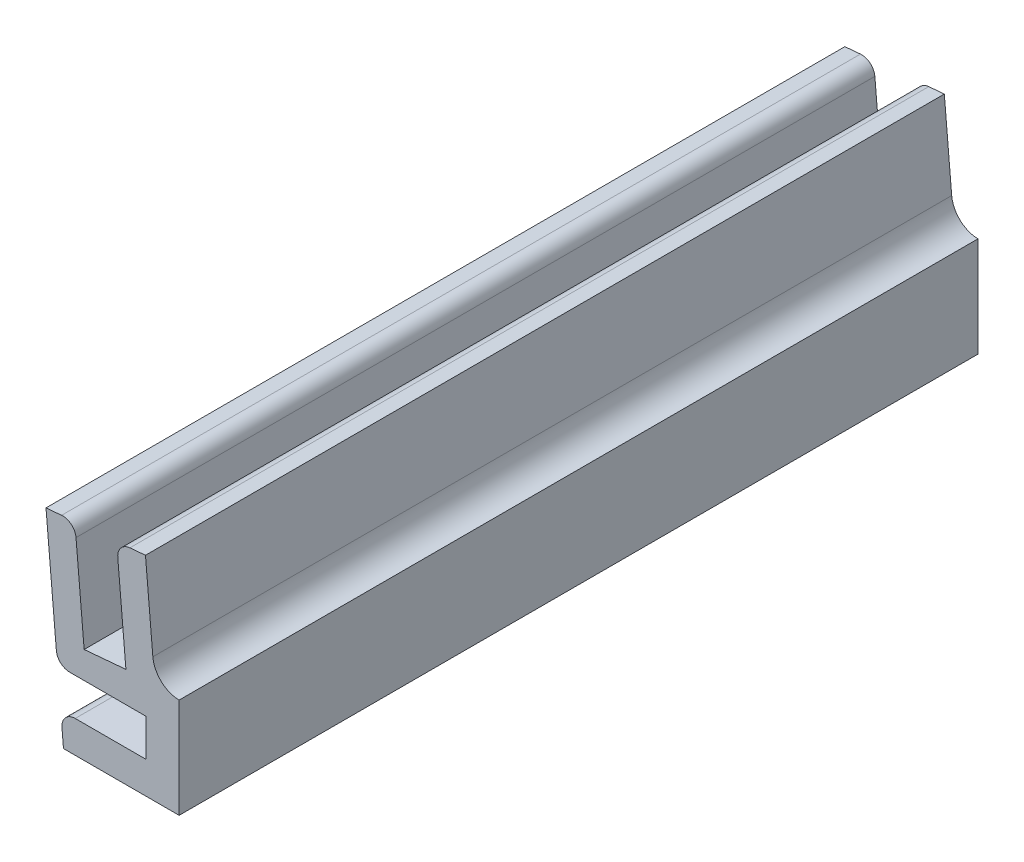
ISO-10303-21;
HEADER;
FILE_DESCRIPTION(('STEP AP214'),'2;1');
FILE_NAME('part.step','',(''),(''),'','','');
FILE_SCHEMA(('AUTOMOTIVE_DESIGN { 1 0 10303 214 1 1 1 1 }'));
ENDSEC;
DATA;
#1=APPLICATION_CONTEXT('core data for automotive mechanical design processes');
#2=APPLICATION_PROTOCOL_DEFINITION('international standard','automotive_design',2000,#1);
#3=PRODUCT_CONTEXT('',#1,'mechanical');
#4=PRODUCT('Part','Part','',(#3));
#5=PRODUCT_RELATED_PRODUCT_CATEGORY('part','',(#4));
#6=PRODUCT_DEFINITION_FORMATION('','',#4);
#7=PRODUCT_DEFINITION_CONTEXT('part definition',#1,'design');
#8=PRODUCT_DEFINITION('design','',#6,#7);
#9=PRODUCT_DEFINITION_SHAPE('','',#8);
#10=(LENGTH_UNIT() NAMED_UNIT(*) SI_UNIT(.MILLI.,.METRE.));
#11=(NAMED_UNIT(*) PLANE_ANGLE_UNIT() SI_UNIT($,.RADIAN.));
#12=(NAMED_UNIT(*) SI_UNIT($,.STERADIAN.) SOLID_ANGLE_UNIT());
#13=UNCERTAINTY_MEASURE_WITH_UNIT(LENGTH_MEASURE(1.E-05),#10,'distance_accuracy_value','');
#14=(GEOMETRIC_REPRESENTATION_CONTEXT(3) GLOBAL_UNCERTAINTY_ASSIGNED_CONTEXT((#13)) GLOBAL_UNIT_ASSIGNED_CONTEXT((#10,
#11,#12)) REPRESENTATION_CONTEXT('',''));
#15=CARTESIAN_POINT('',(0.,0.,0.));
#16=DIRECTION('',(0.,0.,1.));
#17=DIRECTION('',(1.,0.,0.));
#18=AXIS2_PLACEMENT_3D('',#15,#16,#17);
#19=CARTESIAN_POINT('',(-12.7,19.05,38.1));
#20=DIRECTION('',(0.0871557427476552,-0.996194698091746,0.));
#21=DIRECTION('',(0.996194698091746,0.0871557427476552,0.));
#22=AXIS2_PLACEMENT_3D('',#19,#20,#21);
#23=PLANE('',#22);
#24=DIRECTION('',(-0.996194698091746,-0.0871557427476552,0.));
#25=VECTOR('',#24,1.);
#26=CARTESIAN_POINT('',(-12.7,19.05,-38.1));
#27=LINE('',#26,#25);
#28=CARTESIAN_POINT('',(-3.21124550067613,19.8801584496714,-38.1));
#29=VERTEX_POINT('',#28);
#30=CARTESIAN_POINT('',(-4.69806608757805,19.7500785036205,-38.1));
#31=VERTEX_POINT('',#30);
#32=EDGE_CURVE('E235',#29,#31,#27,.T.);
#33=ORIENTED_EDGE('',*,*,#32,.T.);
#34=DIRECTION('',(0.,0.,1.));
#35=VECTOR('',#34,1.);
#36=CARTESIAN_POINT('',(-4.69806608757805,19.7500785036205,38.1));
#37=LINE('',#36,#35);
#38=CARTESIAN_POINT('',(-4.69806608757805,19.7500785036205,38.1));
#39=VERTEX_POINT('',#38);
#40=EDGE_CURVE('E289',#31,#39,#37,.T.);
#41=ORIENTED_EDGE('',*,*,#40,.T.);
#42=DIRECTION('',(-0.996194698091746,-0.0871557427476552,0.));
#43=VECTOR('',#42,1.);
#44=CARTESIAN_POINT('',(-12.7,19.05,38.1));
#45=LINE('',#44,#43);
#46=CARTESIAN_POINT('',(-3.21124550067613,19.8801584496714,38.1));
#47=VERTEX_POINT('',#46);
#48=EDGE_CURVE('E220',#47,#39,#45,.T.);
#49=ORIENTED_EDGE('',*,*,#48,.F.);
#50=DIRECTION('',(0.,0.,-1.));
#51=VECTOR('',#50,1.);
#52=CARTESIAN_POINT('',(-3.21124550067613,19.8801584496714,38.1));
#53=LINE('',#52,#51);
#54=EDGE_CURVE('E251',#47,#29,#53,.T.);
#55=ORIENTED_EDGE('',*,*,#54,.T.);
#56=EDGE_LOOP('',(#33,#41,#49,#55));
#57=FACE_BOUND('',#56,.T.);
#58=ADVANCED_FACE('F35',(#57),#23,.F.);
#59=CARTESIAN_POINT('',(-11.0333409598312,0.,38.1));
#60=DIRECTION('',(0.996194698091746,0.0871557427476553,0.));
#61=DIRECTION('',(-0.0871557427476553,0.996194698091746,0.));
#62=AXIS2_PLACEMENT_3D('',#59,#60,#61);
#63=PLANE('',#62);
#64=DIRECTION('',(0.0871557427476553,-0.996194698091746,0.));
#65=VECTOR('',#64,1.);
#66=CARTESIAN_POINT('',(-11.0333409598312,0.,-38.1));
#67=LINE('',#66,#65);
#68=CARTESIAN_POINT('',(-12.7,19.05,-38.1));
#69=VERTEX_POINT('',#68);
#70=CARTESIAN_POINT('',(-11.7125427693308,7.76331220671048,-38.1));
#71=VERTEX_POINT('',#70);
#72=EDGE_CURVE('E239',#69,#71,#67,.T.);
#73=ORIENTED_EDGE('',*,*,#72,.T.);
#74=DIRECTION('',(0.,0.,1.));
#75=VECTOR('',#74,1.);
#76=CARTESIAN_POINT('',(-11.7125427693308,7.76331220671048,38.1));
#77=LINE('',#76,#75);
#78=CARTESIAN_POINT('',(-11.7125427693308,7.76331220671048,38.1));
#79=VERTEX_POINT('',#78);
#80=EDGE_CURVE('E284',#71,#79,#77,.T.);
#81=ORIENTED_EDGE('',*,*,#80,.T.);
#82=DIRECTION('',(0.0871557427476553,-0.996194698091746,0.));
#83=VECTOR('',#82,1.);
#84=CARTESIAN_POINT('',(-11.0333409598312,0.,38.1));
#85=LINE('',#84,#83);
#86=CARTESIAN_POINT('',(-12.7,19.05,38.1));
#87=VERTEX_POINT('',#86);
#88=EDGE_CURVE('E224',#87,#79,#85,.T.);
#89=ORIENTED_EDGE('',*,*,#88,.F.);
#90=DIRECTION('',(0.,0.,-1.));
#91=VECTOR('',#90,1.);
#92=CARTESIAN_POINT('',(-12.7,19.05,38.1));
#93=LINE('',#92,#91);
#94=EDGE_CURVE('E248',#87,#69,#93,.T.);
#95=ORIENTED_EDGE('',*,*,#94,.T.);
#96=EDGE_LOOP('',(#73,#81,#89,#95));
#97=FACE_BOUND('',#96,.T.);
#98=ADVANCED_FACE('F353',(#97),#63,.F.);
#99=CARTESIAN_POINT('',(0.,9.525,38.1));
#100=DIRECTION('',(-1.,0.,0.));
#101=DIRECTION('',(0.,-1.,0.));
#102=AXIS2_PLACEMENT_3D('',#99,#100,#101);
#103=PLANE('',#102);
#104=DIRECTION('',(0.,1.,0.));
#105=VECTOR('',#104,1.);
#106=CARTESIAN_POINT('',(0.,9.525,-38.1));
#107=LINE('',#106,#105);
#108=CARTESIAN_POINT('',(0.,0.,-38.1));
#109=VERTEX_POINT('',#108);
#110=CARTESIAN_POINT('',(0.,9.525,-38.1));
#111=VERTEX_POINT('',#110);
#112=EDGE_CURVE('E171',#109,#111,#107,.T.);
#113=ORIENTED_EDGE('',*,*,#112,.T.);
#114=DIRECTION('',(0.,0.,-1.));
#115=VECTOR('',#114,1.);
#116=CARTESIAN_POINT('',(0.,9.525,38.1));
#117=LINE('',#116,#115);
#118=CARTESIAN_POINT('',(0.,9.525,38.1));
#119=VERTEX_POINT('',#118);
#120=EDGE_CURVE('E254',#119,#111,#117,.T.);
#121=ORIENTED_EDGE('',*,*,#120,.F.);
#122=DIRECTION('',(0.,1.,0.));
#123=VECTOR('',#122,1.);
#124=CARTESIAN_POINT('',(0.,9.525,38.1));
#125=LINE('',#124,#123);
#126=CARTESIAN_POINT('',(0.,0.,38.1));
#127=VERTEX_POINT('',#126);
#128=EDGE_CURVE('E214',#127,#119,#125,.T.);
#129=ORIENTED_EDGE('',*,*,#128,.F.);
#130=DIRECTION('',(0.,0.,-1.));
#131=VECTOR('',#130,1.);
#132=CARTESIAN_POINT('',(0.,0.,38.1));
#133=LINE('',#132,#131);
#134=EDGE_CURVE('E229',#127,#109,#133,.T.);
#135=ORIENTED_EDGE('',*,*,#134,.T.);
#136=EDGE_LOOP('',(#113,#121,#129,#135));
#137=FACE_BOUND('',#136,.T.);
#138=ADVANCED_FACE('F318',(#137),#103,.F.);
#139=CARTESIAN_POINT('',(-3.21124550067613,19.8801584496714,38.1));
#140=DIRECTION('',(-0.996194698091746,-0.0871557427476552,0.));
#141=DIRECTION('',(0.0871557427476552,-0.996194698091746,0.));
#142=AXIS2_PLACEMENT_3D('',#139,#140,#141);
#143=PLANE('',#142);
#144=DIRECTION('',(-0.0871557427476552,0.996194698091746,0.));
#145=VECTOR('',#144,1.);
#146=CARTESIAN_POINT('',(-3.21124550067613,19.8801584496714,38.1));
#147=LINE('',#146,#145);
#148=CARTESIAN_POINT('',(-2.5081313881186,11.843527368329,38.1));
#149=VERTEX_POINT('',#148);
#150=EDGE_CURVE('E216',#149,#47,#147,.T.);
#151=ORIENTED_EDGE('',*,*,#150,.F.);
#152=DIRECTION('',(0.,0.,-1.));
#153=VECTOR('',#152,1.);
#154=CARTESIAN_POINT('',(-2.5081313881186,11.843527368329,38.1));
#155=LINE('',#154,#153);
#156=CARTESIAN_POINT('',(-2.5081313881186,11.843527368329,-38.1));
#157=VERTEX_POINT('',#156);
#158=EDGE_CURVE('E257',#149,#157,#155,.T.);
#159=ORIENTED_EDGE('',*,*,#158,.T.);
#160=DIRECTION('',(-0.0871557427476552,0.996194698091746,0.));
#161=VECTOR('',#160,1.);
#162=CARTESIAN_POINT('',(-3.21124550067613,19.8801584496714,-38.1));
#163=LINE('',#162,#161);
#164=EDGE_CURVE('E232',#157,#29,#163,.T.);
#165=ORIENTED_EDGE('',*,*,#164,.T.);
#166=ORIENTED_EDGE('',*,*,#54,.F.);
#167=EDGE_LOOP('',(#151,#159,#165,#166));
#168=FACE_BOUND('',#167,.T.);
#169=ADVANCED_FACE('F311',(#168),#143,.F.);
#170=CARTESIAN_POINT('',(-11.2131794130981,19.1800799460509,38.1));
#171=VERTEX_POINT('',#170);
#172=EDGE_CURVE('E219',#171,#87,#45,.T.);
#173=ORIENTED_EDGE('',*,*,#172,.F.);
#174=DIRECTION('',(0.,0.,1.));
#175=VECTOR('',#174,1.);
#176=CARTESIAN_POINT('',(-11.2131794130981,19.1800799460509,38.1));
#177=LINE('',#176,#175);
#178=CARTESIAN_POINT('',(-11.2131794130981,19.1800799460509,-38.1));
#179=VERTEX_POINT('',#178);
#180=EDGE_CURVE('E11',#171,#179,#177,.F.);
#181=ORIENTED_EDGE('',*,*,#180,.T.);
#182=EDGE_CURVE('E234',#179,#69,#27,.T.);
#183=ORIENTED_EDGE('',*,*,#182,.T.);
#184=ORIENTED_EDGE('',*,*,#94,.F.);
#185=EDGE_LOOP('',(#173,#181,#183,#184));
#186=FACE_BOUND('',#185,.T.);
#187=ADVANCED_FACE('F355',(#186),#23,.F.);
#188=CARTESIAN_POINT('',(-11.1792118764768,1.66731220671048,38.1));
#189=VERTEX_POINT('',#188);
#190=CARTESIAN_POINT('',(-11.0333409598312,0.,38.1));
#191=VERTEX_POINT('',#190);
#192=EDGE_CURVE('E223',#189,#191,#85,.T.);
#193=ORIENTED_EDGE('',*,*,#192,.F.);
#194=DIRECTION('',(0.,0.,1.));
#195=VECTOR('',#194,1.);
#196=CARTESIAN_POINT('',(-11.1792118764768,1.66731220671048,38.1));
#197=LINE('',#196,#195);
#198=CARTESIAN_POINT('',(-11.1792118764768,1.66731220671048,-38.1));
#199=VERTEX_POINT('',#198);
#200=EDGE_CURVE('E275',#189,#199,#197,.F.);
#201=ORIENTED_EDGE('',*,*,#200,.T.);
#202=CARTESIAN_POINT('',(-11.0333409598312,0.,-38.1));
#203=VERTEX_POINT('',#202);
#204=EDGE_CURVE('E238',#199,#203,#67,.T.);
#205=ORIENTED_EDGE('',*,*,#204,.T.);
#206=DIRECTION('',(0.,0.,-1.));
#207=VECTOR('',#206,1.);
#208=CARTESIAN_POINT('',(-11.0333409598312,0.,38.1));
#209=LINE('',#208,#207);
#210=EDGE_CURVE('E245',#191,#203,#209,.T.);
#211=ORIENTED_EDGE('',*,*,#210,.F.);
#212=EDGE_LOOP('',(#193,#201,#205,#211));
#213=FACE_BOUND('',#212,.T.);
#214=ADVANCED_FACE('F366',(#213),#63,.F.);
#215=CARTESIAN_POINT('',(0.,0.,38.1));
#216=DIRECTION('',(0.,1.,0.));
#217=DIRECTION('',(-1.,0.,0.));
#218=AXIS2_PLACEMENT_3D('',#215,#216,#217);
#219=PLANE('',#218);
#220=DIRECTION('',(1.,0.,0.));
#221=VECTOR('',#220,1.);
#222=CARTESIAN_POINT('',(0.,0.,-38.1));
#223=LINE('',#222,#221);
#224=EDGE_CURVE('E217',#203,#109,#223,.T.);
#225=ORIENTED_EDGE('',*,*,#224,.T.);
#226=ORIENTED_EDGE('',*,*,#134,.F.);
#227=DIRECTION('',(1.,0.,0.));
#228=VECTOR('',#227,1.);
#229=CARTESIAN_POINT('',(0.,0.,38.1));
#230=LINE('',#229,#228);
#231=EDGE_CURVE('E227',#191,#127,#230,.T.);
#232=ORIENTED_EDGE('',*,*,#231,.F.);
#233=ORIENTED_EDGE('',*,*,#210,.T.);
#234=EDGE_LOOP('',(#225,#226,#232,#233));
#235=FACE_BOUND('',#234,.T.);
#236=ADVANCED_FACE('F327',(#235),#219,.F.);
#237=CARTESIAN_POINT('',(0.,0.,38.1));
#238=DIRECTION('',(0.,0.,-1.));
#239=DIRECTION('',(-1.,0.,0.));
#240=AXIS2_PLACEMENT_3D('',#237,#238,#239);
#241=PLANE('',#240);
#242=DIRECTION('',(1.,0.,0.));
#243=VECTOR('',#242,1.);
#244=CARTESIAN_POINT('',(-3.175,3.048,38.1));
#245=LINE('',#244,#243);
#246=CARTESIAN_POINT('',(-9.91404460990024,3.048,38.1));
#247=VERTEX_POINT('',#246);
#248=CARTESIAN_POINT('',(-3.175,3.048,38.1));
#249=VERTEX_POINT('',#248);
#250=EDGE_CURVE('E204',#247,#249,#245,.T.);
#251=ORIENTED_EDGE('',*,*,#250,.F.);
#252=CARTESIAN_POINT('',(-9.91404460990024,1.778,38.1));
#253=DIRECTION('',(0.,0.,-1.));
#254=DIRECTION('',(-1.,0.,0.));
#255=AXIS2_PLACEMENT_3D('',#252,#253,#254);
#256=CIRCLE('',#255,1.27);
#257=EDGE_CURVE('E273',#247,#189,#256,.F.);
#258=ORIENTED_EDGE('',*,*,#257,.T.);
#259=ORIENTED_EDGE('',*,*,#192,.T.);
#260=ORIENTED_EDGE('',*,*,#231,.T.);
#261=ORIENTED_EDGE('',*,*,#128,.T.);
#262=CARTESIAN_POINT('',(0.0222031450344347,12.064902954908,38.1));
#263=DIRECTION('',(0.,0.,-1.));
#264=DIRECTION('',(-1.,0.,0.));
#265=AXIS2_PLACEMENT_3D('',#262,#263,#264);
#266=CIRCLE('',#265,2.54);
#267=EDGE_CURVE('E262',#119,#149,#266,.T.);
#268=ORIENTED_EDGE('',*,*,#267,.T.);
#269=ORIENTED_EDGE('',*,*,#150,.T.);
#270=ORIENTED_EDGE('',*,*,#48,.T.);
#271=CARTESIAN_POINT('',(-4.58737829428853,18.484911237044,38.1));
#272=DIRECTION('',(0.,0.,-1.));
#273=DIRECTION('',(-1.,0.,0.));
#274=AXIS2_PLACEMENT_3D('',#271,#272,#273);
#275=CIRCLE('',#274,1.27);
#276=CARTESIAN_POINT('',(-5.85254556086505,18.3742234437545,38.1));
#277=VERTEX_POINT('',#276);
#278=EDGE_CURVE('E269',#39,#277,#275,.F.);
#279=ORIENTED_EDGE('',*,*,#278,.T.);
#280=DIRECTION('',(-0.0871557427476555,0.996194698091746,0.));
#281=VECTOR('',#280,1.);
#282=CARTESIAN_POINT('',(-5.96323335415457,19.639390710331,38.1));
#283=LINE('',#282,#281);
#284=CARTESIAN_POINT('',(-5.07773100783839,9.51805257771888,38.1));
#285=VERTEX_POINT('',#284);
#286=EDGE_CURVE('E185',#285,#277,#283,.T.);
#287=ORIENTED_EDGE('',*,*,#286,.F.);
#288=DIRECTION('',(0.996194698091746,0.0871557427476558,0.));
#289=VECTOR('',#288,1.);
#290=CARTESIAN_POINT('',(-5.07773100783839,9.51805257771888,38.1));
#291=LINE('',#290,#289);
#292=CARTESIAN_POINT('',(-9.06250980020537,9.16942960672826,38.1));
#293=VERTEX_POINT('',#292);
#294=EDGE_CURVE('E167',#293,#285,#291,.T.);
#295=ORIENTED_EDGE('',*,*,#294,.F.);
#296=DIRECTION('',(0.0871557427476557,-0.996194698091746,0.));
#297=VECTOR('',#296,1.);
#298=CARTESIAN_POINT('',(-9.06250980020537,9.16942960672826,38.1));
#299=LINE('',#298,#297);
#300=CARTESIAN_POINT('',(-9.83732435323203,18.0256004727639,38.1));
#301=VERTEX_POINT('',#300);
#302=EDGE_CURVE('E188',#301,#293,#299,.T.);
#303=ORIENTED_EDGE('',*,*,#302,.F.);
#304=CARTESIAN_POINT('',(-11.1024916198085,17.9149126794744,38.1));
#305=DIRECTION('',(0.,0.,-1.));
#306=DIRECTION('',(-1.,0.,0.));
#307=AXIS2_PLACEMENT_3D('',#304,#305,#306);
#308=CIRCLE('',#307,1.27);
#309=EDGE_CURVE('E267',#301,#171,#308,.F.);
#310=ORIENTED_EDGE('',*,*,#309,.T.);
#311=ORIENTED_EDGE('',*,*,#172,.T.);
#312=ORIENTED_EDGE('',*,*,#88,.T.);
#313=CARTESIAN_POINT('',(-10.4473755027543,7.874,38.1));
#314=DIRECTION('',(0.,0.,-1.));
#315=DIRECTION('',(-1.,0.,0.));
#316=AXIS2_PLACEMENT_3D('',#313,#314,#315);
#317=CIRCLE('',#316,1.27);
#318=CARTESIAN_POINT('',(-10.4473755027543,6.604,38.1));
#319=VERTEX_POINT('',#318);
#320=EDGE_CURVE('E271',#79,#319,#317,.F.);
#321=ORIENTED_EDGE('',*,*,#320,.T.);
#322=DIRECTION('',(-1.,0.,0.));
#323=VECTOR('',#322,1.);
#324=CARTESIAN_POINT('',(-11.6111160937564,6.604,38.1));
#325=LINE('',#324,#323);
#326=CARTESIAN_POINT('',(-3.175,6.604,38.1));
#327=VERTEX_POINT('',#326);
#328=EDGE_CURVE('E197',#327,#319,#325,.T.);
#329=ORIENTED_EDGE('',*,*,#328,.F.);
#330=DIRECTION('',(0.,1.,0.));
#331=VECTOR('',#330,1.);
#332=CARTESIAN_POINT('',(-3.175,6.604,38.1));
#333=LINE('',#332,#331);
#334=EDGE_CURVE('E206',#249,#327,#333,.T.);
#335=ORIENTED_EDGE('',*,*,#334,.F.);
#336=EDGE_LOOP('',(#251,#258,#259,#260,#261,#268,#269,#270,#279,#287,#295,#303,#310,#311,#312,
#321,#329,#335));
#337=FACE_BOUND('',#336,.T.);
#338=ADVANCED_FACE('F300',(#337),#241,.F.);
#339=CARTESIAN_POINT('',(0.,0.,-38.1));
#340=DIRECTION('',(0.,0.,-1.));
#341=DIRECTION('',(-1.,0.,0.));
#342=AXIS2_PLACEMENT_3D('',#339,#340,#341);
#343=PLANE('',#342);
#344=ORIENTED_EDGE('',*,*,#204,.F.);
#345=CARTESIAN_POINT('',(-9.91404460990024,1.778,-38.1));
#346=DIRECTION('',(0.,0.,-1.));
#347=DIRECTION('',(-1.,0.,0.));
#348=AXIS2_PLACEMENT_3D('',#345,#346,#347);
#349=CIRCLE('',#348,1.27);
#350=CARTESIAN_POINT('',(-9.91404460990024,3.048,-38.1));
#351=VERTEX_POINT('',#350);
#352=EDGE_CURVE('E282',#199,#351,#349,.T.);
#353=ORIENTED_EDGE('',*,*,#352,.T.);
#354=DIRECTION('',(1.,0.,0.));
#355=VECTOR('',#354,1.);
#356=CARTESIAN_POINT('',(-3.175,3.048,-38.1));
#357=LINE('',#356,#355);
#358=CARTESIAN_POINT('',(-3.175,3.048,-38.1));
#359=VERTEX_POINT('',#358);
#360=EDGE_CURVE('E194',#351,#359,#357,.T.);
#361=ORIENTED_EDGE('',*,*,#360,.T.);
#362=DIRECTION('',(0.,1.,0.));
#363=VECTOR('',#362,1.);
#364=CARTESIAN_POINT('',(-3.175,6.604,-38.1));
#365=LINE('',#364,#363);
#366=CARTESIAN_POINT('',(-3.175,6.604,-38.1));
#367=VERTEX_POINT('',#366);
#368=EDGE_CURVE('E196',#359,#367,#365,.T.);
#369=ORIENTED_EDGE('',*,*,#368,.T.);
#370=DIRECTION('',(-1.,0.,0.));
#371=VECTOR('',#370,1.);
#372=CARTESIAN_POINT('',(-11.6111160937564,6.604,-38.1));
#373=LINE('',#372,#371);
#374=CARTESIAN_POINT('',(-10.4473755027543,6.604,-38.1));
#375=VERTEX_POINT('',#374);
#376=EDGE_CURVE('E200',#367,#375,#373,.T.);
#377=ORIENTED_EDGE('',*,*,#376,.T.);
#378=CARTESIAN_POINT('',(-10.4473755027543,7.874,-38.1));
#379=DIRECTION('',(0.,0.,-1.));
#380=DIRECTION('',(-1.,0.,0.));
#381=AXIS2_PLACEMENT_3D('',#378,#379,#380);
#382=CIRCLE('',#381,1.27);
#383=EDGE_CURVE('E280',#375,#71,#382,.T.);
#384=ORIENTED_EDGE('',*,*,#383,.T.);
#385=ORIENTED_EDGE('',*,*,#72,.F.);
#386=ORIENTED_EDGE('',*,*,#182,.F.);
#387=CARTESIAN_POINT('',(-11.1024916198085,17.9149126794744,-38.1));
#388=DIRECTION('',(0.,0.,-1.));
#389=DIRECTION('',(-1.,0.,0.));
#390=AXIS2_PLACEMENT_3D('',#387,#388,#389);
#391=CIRCLE('',#390,1.27);
#392=CARTESIAN_POINT('',(-9.83732435323203,18.0256004727639,-38.1));
#393=VERTEX_POINT('',#392);
#394=EDGE_CURVE('E50',#179,#393,#391,.T.);
#395=ORIENTED_EDGE('',*,*,#394,.T.);
#396=DIRECTION('',(0.0871557427476557,-0.996194698091746,0.));
#397=VECTOR('',#396,1.);
#398=CARTESIAN_POINT('',(-9.06250980020537,9.16942960672826,-38.1));
#399=LINE('',#398,#397);
#400=CARTESIAN_POINT('',(-9.06250980020537,9.16942960672826,-38.1));
#401=VERTEX_POINT('',#400);
#402=EDGE_CURVE('E183',#393,#401,#399,.T.);
#403=ORIENTED_EDGE('',*,*,#402,.T.);
#404=DIRECTION('',(0.996194698091746,0.0871557427476558,0.));
#405=VECTOR('',#404,1.);
#406=CARTESIAN_POINT('',(-5.07773100783839,9.51805257771888,-38.1));
#407=LINE('',#406,#405);
#408=CARTESIAN_POINT('',(-5.07773100783839,9.51805257771888,-38.1));
#409=VERTEX_POINT('',#408);
#410=EDGE_CURVE('E164',#401,#409,#407,.T.);
#411=ORIENTED_EDGE('',*,*,#410,.T.);
#412=DIRECTION('',(-0.0871557427476555,0.996194698091746,0.));
#413=VECTOR('',#412,1.);
#414=CARTESIAN_POINT('',(-5.96323335415457,19.639390710331,-38.1));
#415=LINE('',#414,#413);
#416=CARTESIAN_POINT('',(-5.85254556086505,18.3742234437545,-38.1));
#417=VERTEX_POINT('',#416);
#418=EDGE_CURVE('E175',#409,#417,#415,.T.);
#419=ORIENTED_EDGE('',*,*,#418,.T.);
#420=CARTESIAN_POINT('',(-4.58737829428853,18.484911237044,-38.1));
#421=DIRECTION('',(0.,0.,-1.));
#422=DIRECTION('',(-1.,0.,0.));
#423=AXIS2_PLACEMENT_3D('',#420,#421,#422);
#424=CIRCLE('',#423,1.27);
#425=EDGE_CURVE('E278',#417,#31,#424,.T.);
#426=ORIENTED_EDGE('',*,*,#425,.T.);
#427=ORIENTED_EDGE('',*,*,#32,.F.);
#428=ORIENTED_EDGE('',*,*,#164,.F.);
#429=CARTESIAN_POINT('',(0.0222031450344347,12.064902954908,-38.1));
#430=DIRECTION('',(0.,0.,-1.));
#431=DIRECTION('',(-1.,0.,0.));
#432=AXIS2_PLACEMENT_3D('',#429,#430,#431);
#433=CIRCLE('',#432,2.54);
#434=EDGE_CURVE('E260',#157,#111,#433,.F.);
#435=ORIENTED_EDGE('',*,*,#434,.T.);
#436=ORIENTED_EDGE('',*,*,#112,.F.);
#437=ORIENTED_EDGE('',*,*,#224,.F.);
#438=EDGE_LOOP('',(#344,#353,#361,#369,#377,#384,#385,#386,#395,#403,#411,#419,#426,#427,#428,
#435,#436,#437));
#439=FACE_BOUND('',#438,.T.);
#440=ADVANCED_FACE('F182',(#439),#343,.T.);
#441=CARTESIAN_POINT('',(-11.6111160937564,6.604,-38.1));
#442=DIRECTION('',(0.,1.,0.));
#443=DIRECTION('',(0.,0.,1.));
#444=AXIS2_PLACEMENT_3D('',#441,#442,#443);
#445=PLANE('',#444);
#446=ORIENTED_EDGE('',*,*,#328,.T.);
#447=DIRECTION('',(0.,0.,1.));
#448=VECTOR('',#447,1.);
#449=CARTESIAN_POINT('',(-10.4473755027543,6.604,-38.1));
#450=LINE('',#449,#448);
#451=EDGE_CURVE('E287',#319,#375,#450,.F.);
#452=ORIENTED_EDGE('',*,*,#451,.T.);
#453=ORIENTED_EDGE('',*,*,#376,.F.);
#454=DIRECTION('',(0.,0.,1.));
#455=VECTOR('',#454,1.);
#456=CARTESIAN_POINT('',(-3.175,6.604,-38.1));
#457=LINE('',#456,#455);
#458=EDGE_CURVE('E190',#367,#327,#457,.T.);
#459=ORIENTED_EDGE('',*,*,#458,.T.);
#460=EDGE_LOOP('',(#446,#452,#453,#459));
#461=FACE_BOUND('',#460,.T.);
#462=ADVANCED_FACE('F446',(#461),#445,.F.);
#463=CARTESIAN_POINT('',(-3.175,6.604,-38.1));
#464=DIRECTION('',(1.,0.,0.));
#465=DIRECTION('',(0.,0.,-1.));
#466=AXIS2_PLACEMENT_3D('',#463,#464,#465);
#467=PLANE('',#466);
#468=ORIENTED_EDGE('',*,*,#334,.T.);
#469=ORIENTED_EDGE('',*,*,#458,.F.);
#470=ORIENTED_EDGE('',*,*,#368,.F.);
#471=DIRECTION('',(0.,0.,1.));
#472=VECTOR('',#471,1.);
#473=CARTESIAN_POINT('',(-3.175,3.048,-38.1));
#474=LINE('',#473,#472);
#475=EDGE_CURVE('E203',#359,#249,#474,.T.);
#476=ORIENTED_EDGE('',*,*,#475,.T.);
#477=EDGE_LOOP('',(#468,#469,#470,#476));
#478=FACE_BOUND('',#477,.T.);
#479=ADVANCED_FACE('F341',(#478),#467,.F.);
#480=CARTESIAN_POINT('',(-3.175,3.048,-38.1));
#481=DIRECTION('',(0.,-1.,0.));
#482=DIRECTION('',(1.,0.,0.));
#483=AXIS2_PLACEMENT_3D('',#480,#481,#482);
#484=PLANE('',#483);
#485=ORIENTED_EDGE('',*,*,#360,.F.);
#486=DIRECTION('',(0.,0.,1.));
#487=VECTOR('',#486,1.);
#488=CARTESIAN_POINT('',(-9.91404460990024,3.048,-38.1));
#489=LINE('',#488,#487);
#490=EDGE_CURVE('E264',#351,#247,#489,.T.);
#491=ORIENTED_EDGE('',*,*,#490,.T.);
#492=ORIENTED_EDGE('',*,*,#250,.T.);
#493=ORIENTED_EDGE('',*,*,#475,.F.);
#494=EDGE_LOOP('',(#485,#491,#492,#493));
#495=FACE_BOUND('',#494,.T.);
#496=ADVANCED_FACE('F336',(#495),#484,.F.);
#497=CARTESIAN_POINT('',(-5.96323335415457,19.639390710331,-38.1));
#498=DIRECTION('',(0.996194698091746,0.0871557427476556,0.));
#499=DIRECTION('',(-0.0871557427476556,0.996194698091746,0.));
#500=AXIS2_PLACEMENT_3D('',#497,#498,#499);
#501=PLANE('',#500);
#502=ORIENTED_EDGE('',*,*,#286,.T.);
#503=DIRECTION('',(0.,0.,1.));
#504=VECTOR('',#503,1.);
#505=CARTESIAN_POINT('',(-5.85254556086505,18.3742234437545,-38.1));
#506=LINE('',#505,#504);
#507=EDGE_CURVE('E178',#277,#417,#506,.F.);
#508=ORIENTED_EDGE('',*,*,#507,.T.);
#509=ORIENTED_EDGE('',*,*,#418,.F.);
#510=DIRECTION('',(0.,0.,1.));
#511=VECTOR('',#510,1.);
#512=CARTESIAN_POINT('',(-5.07773100783839,9.51805257771888,-38.1));
#513=LINE('',#512,#511);
#514=EDGE_CURVE('E159',#409,#285,#513,.T.);
#515=ORIENTED_EDGE('',*,*,#514,.T.);
#516=EDGE_LOOP('',(#502,#508,#509,#515));
#517=FACE_BOUND('',#516,.T.);
#518=ADVANCED_FACE('F176',(#517),#501,.F.);
#519=CARTESIAN_POINT('',(-5.07773100783839,9.51805257771888,-38.1));
#520=DIRECTION('',(0.0871557427476558,-0.996194698091746,0.));
#521=DIRECTION('',(0.996194698091746,0.0871557427476558,0.));
#522=AXIS2_PLACEMENT_3D('',#519,#520,#521);
#523=PLANE('',#522);
#524=ORIENTED_EDGE('',*,*,#294,.T.);
#525=ORIENTED_EDGE('',*,*,#514,.F.);
#526=ORIENTED_EDGE('',*,*,#410,.F.);
#527=DIRECTION('',(0.,0.,1.));
#528=VECTOR('',#527,1.);
#529=CARTESIAN_POINT('',(-9.06250980020537,9.16942960672826,-38.1));
#530=LINE('',#529,#528);
#531=EDGE_CURVE('E172',#401,#293,#530,.T.);
#532=ORIENTED_EDGE('',*,*,#531,.T.);
#533=EDGE_LOOP('',(#524,#525,#526,#532));
#534=FACE_BOUND('',#533,.T.);
#535=ADVANCED_FACE('F161',(#534),#523,.F.);
#536=CARTESIAN_POINT('',(-9.06250980020537,9.16942960672826,-38.1));
#537=DIRECTION('',(-0.996194698091746,-0.0871557427476557,0.));
#538=DIRECTION('',(0.0871557427476557,-0.996194698091746,0.));
#539=AXIS2_PLACEMENT_3D('',#536,#537,#538);
#540=PLANE('',#539);
#541=ORIENTED_EDGE('',*,*,#402,.F.);
#542=DIRECTION('',(0.,0.,1.));
#543=VECTOR('',#542,1.);
#544=CARTESIAN_POINT('',(-9.83732435323203,18.0256004727639,-38.1));
#545=LINE('',#544,#543);
#546=EDGE_CURVE('E43',#393,#301,#545,.T.);
#547=ORIENTED_EDGE('',*,*,#546,.T.);
#548=ORIENTED_EDGE('',*,*,#302,.T.);
#549=ORIENTED_EDGE('',*,*,#531,.F.);
#550=EDGE_LOOP('',(#541,#547,#548,#549));
#551=FACE_BOUND('',#550,.T.);
#552=ADVANCED_FACE('F296',(#551),#540,.F.);
#553=CARTESIAN_POINT('',(0.0222031450344347,12.064902954908,38.1));
#554=DIRECTION('',(0.,0.,-1.));
#555=DIRECTION('',(-1.,0.,0.));
#556=AXIS2_PLACEMENT_3D('',#553,#554,#555);
#557=CYLINDRICAL_SURFACE('',#556,2.54);
#558=ORIENTED_EDGE('',*,*,#267,.F.);
#559=ORIENTED_EDGE('',*,*,#120,.T.);
#560=ORIENTED_EDGE('',*,*,#434,.F.);
#561=ORIENTED_EDGE('',*,*,#158,.F.);
#562=EDGE_LOOP('',(#558,#559,#560,#561));
#563=FACE_BOUND('',#562,.T.);
#564=ADVANCED_FACE('F322',(#563),#557,.F.);
#565=CARTESIAN_POINT('',(-9.91404460990024,1.778,-38.1));
#566=DIRECTION('',(0.,0.,1.));
#567=DIRECTION('',(1.,0.,0.));
#568=AXIS2_PLACEMENT_3D('',#565,#566,#567);
#569=CYLINDRICAL_SURFACE('',#568,1.27);
#570=ORIENTED_EDGE('',*,*,#352,.F.);
#571=ORIENTED_EDGE('',*,*,#200,.F.);
#572=ORIENTED_EDGE('',*,*,#257,.F.);
#573=ORIENTED_EDGE('',*,*,#490,.F.);
#574=EDGE_LOOP('',(#570,#571,#572,#573));
#575=FACE_BOUND('',#574,.T.);
#576=ADVANCED_FACE('F334',(#575),#569,.T.);
#577=CARTESIAN_POINT('',(-10.4473755027543,7.874,38.1));
#578=DIRECTION('',(0.,0.,1.));
#579=DIRECTION('',(1.,0.,0.));
#580=AXIS2_PLACEMENT_3D('',#577,#578,#579);
#581=CYLINDRICAL_SURFACE('',#580,1.27);
#582=ORIENTED_EDGE('',*,*,#383,.F.);
#583=ORIENTED_EDGE('',*,*,#451,.F.);
#584=ORIENTED_EDGE('',*,*,#320,.F.);
#585=ORIENTED_EDGE('',*,*,#80,.F.);
#586=EDGE_LOOP('',(#582,#583,#584,#585));
#587=FACE_BOUND('',#586,.T.);
#588=ADVANCED_FACE('F350',(#587),#581,.T.);
#589=CARTESIAN_POINT('',(-4.58737829428853,18.484911237044,38.1));
#590=DIRECTION('',(0.,0.,1.));
#591=DIRECTION('',(1.,0.,0.));
#592=AXIS2_PLACEMENT_3D('',#589,#590,#591);
#593=CYLINDRICAL_SURFACE('',#592,1.27);
#594=ORIENTED_EDGE('',*,*,#425,.F.);
#595=ORIENTED_EDGE('',*,*,#507,.F.);
#596=ORIENTED_EDGE('',*,*,#278,.F.);
#597=ORIENTED_EDGE('',*,*,#40,.F.);
#598=EDGE_LOOP('',(#594,#595,#596,#597));
#599=FACE_BOUND('',#598,.T.);
#600=ADVANCED_FACE('F302',(#599),#593,.T.);
#601=CARTESIAN_POINT('',(-11.1024916198085,17.9149126794744,-38.1));
#602=DIRECTION('',(0.,0.,1.));
#603=DIRECTION('',(1.,0.,0.));
#604=AXIS2_PLACEMENT_3D('',#601,#602,#603);
#605=CYLINDRICAL_SURFACE('',#604,1.27);
#606=ORIENTED_EDGE('',*,*,#394,.F.);
#607=ORIENTED_EDGE('',*,*,#180,.F.);
#608=ORIENTED_EDGE('',*,*,#309,.F.);
#609=ORIENTED_EDGE('',*,*,#546,.F.);
#610=EDGE_LOOP('',(#606,#607,#608,#609));
#611=FACE_BOUND('',#610,.T.);
#612=ADVANCED_FACE('F37',(#611),#605,.T.);
#613=CLOSED_SHELL('',(#58,#98,#138,#169,#187,#214,#236,#338,#440,#462,#479,#496,#518,#535,#552,
#564,#576,#588,#600,#612));
#614=MANIFOLD_SOLID_BREP('B2',#613);
#615=ADVANCED_BREP_SHAPE_REPRESENTATION('',(#18,#614),#14);
#616=SHAPE_DEFINITION_REPRESENTATION(#9,#615);
ENDSEC;
END-ISO-10303-21;
